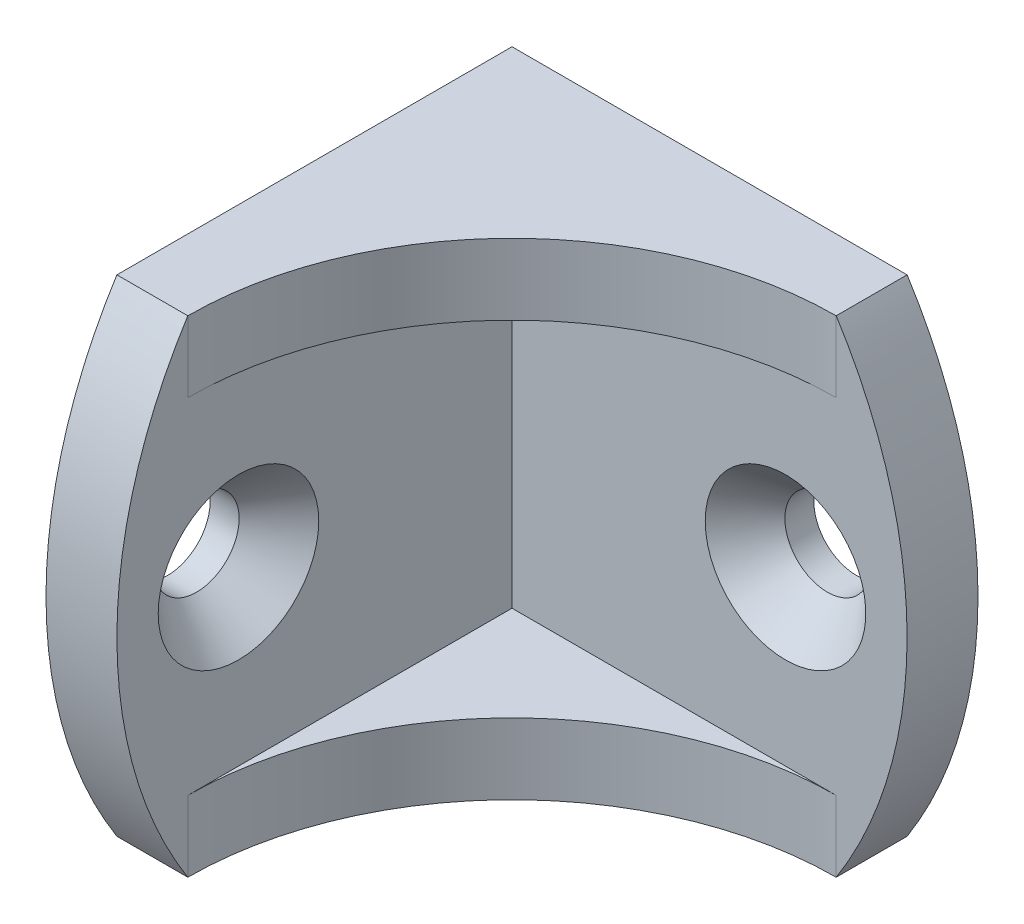
ISO-10303-21;
HEADER;
FILE_DESCRIPTION(('STEP AP214'),'2;1');
FILE_NAME('part.step','',(''),(''),'','','');
FILE_SCHEMA(('AUTOMOTIVE_DESIGN { 1 0 10303 214 1 1 1 1 }'));
ENDSEC;
DATA;
#1=APPLICATION_CONTEXT('core data for automotive mechanical design processes');
#2=APPLICATION_PROTOCOL_DEFINITION('international standard','automotive_design',2000,#1);
#3=PRODUCT_CONTEXT('',#1,'mechanical');
#4=PRODUCT('Part','Part','',(#3));
#5=PRODUCT_RELATED_PRODUCT_CATEGORY('part','',(#4));
#6=PRODUCT_DEFINITION_FORMATION('','',#4);
#7=PRODUCT_DEFINITION_CONTEXT('part definition',#1,'design');
#8=PRODUCT_DEFINITION('design','',#6,#7);
#9=PRODUCT_DEFINITION_SHAPE('','',#8);
#10=(LENGTH_UNIT() NAMED_UNIT(*) SI_UNIT(.MILLI.,.METRE.));
#11=(NAMED_UNIT(*) PLANE_ANGLE_UNIT() SI_UNIT($,.RADIAN.));
#12=(NAMED_UNIT(*) SI_UNIT($,.STERADIAN.) SOLID_ANGLE_UNIT());
#13=UNCERTAINTY_MEASURE_WITH_UNIT(LENGTH_MEASURE(1.E-05),#10,'distance_accuracy_value','');
#14=(GEOMETRIC_REPRESENTATION_CONTEXT(3) GLOBAL_UNCERTAINTY_ASSIGNED_CONTEXT((#13)) GLOBAL_UNIT_ASSIGNED_CONTEXT((#10,
#11,#12)) REPRESENTATION_CONTEXT('',''));
#15=CARTESIAN_POINT('',(0.,0.,0.));
#16=DIRECTION('',(0.,0.,1.));
#17=DIRECTION('',(1.,0.,0.));
#18=AXIS2_PLACEMENT_3D('',#15,#16,#17);
#19=CARTESIAN_POINT('',(17.,0.,0.));
#20=DIRECTION('',(0.,0.,1.));
#21=DIRECTION('',(1.,0.,0.));
#22=AXIS2_PLACEMENT_3D('',#19,#20,#21);
#23=CYLINDRICAL_SURFACE('',#22,2.1);
#24=CARTESIAN_POINT('',(17.,0.,0.));
#25=DIRECTION('',(0.,0.,1.));
#26=DIRECTION('',(-1.,0.,0.));
#27=AXIS2_PLACEMENT_3D('',#24,#25,#26);
#28=CIRCLE('',#27,2.1);
#29=CARTESIAN_POINT('',(14.9,0.,0.));
#30=VERTEX_POINT('',#29);
#31=EDGE_CURVE('E123',#30,#30,#28,.T.);
#32=ORIENTED_EDGE('',*,*,#31,.F.);
#33=EDGE_LOOP('',(#32));
#34=FACE_BOUND('',#33,.T.);
#35=CARTESIAN_POINT('',(17.,0.,1.43159525238213));
#36=DIRECTION('',(0.,0.,1.));
#37=DIRECTION('',(1.,0.,0.));
#38=AXIS2_PLACEMENT_3D('',#35,#36,#37);
#39=CIRCLE('',#38,2.1);
#40=CARTESIAN_POINT('',(19.1,0.,1.43159525238213));
#41=VERTEX_POINT('',#40);
#42=EDGE_CURVE('E40',#41,#41,#39,.F.);
#43=ORIENTED_EDGE('',*,*,#42,.F.);
#44=EDGE_LOOP('',(#43));
#45=FACE_BOUND('',#44,.T.);
#46=ADVANCED_FACE('F36',(#34,#45),#23,.F.);
#47=CARTESIAN_POINT('',(0.,0.,17.));
#48=DIRECTION('',(1.,0.,0.));
#49=DIRECTION('',(0.,0.,-1.));
#50=AXIS2_PLACEMENT_3D('',#47,#48,#49);
#51=CYLINDRICAL_SURFACE('',#50,2.1);
#52=CARTESIAN_POINT('',(0.,0.,17.));
#53=DIRECTION('',(1.,0.,0.));
#54=DIRECTION('',(0.,0.,-1.));
#55=AXIS2_PLACEMENT_3D('',#52,#53,#54);
#56=CIRCLE('',#55,2.1);
#57=CARTESIAN_POINT('',(0.,0.,14.9));
#58=VERTEX_POINT('',#57);
#59=EDGE_CURVE('E166',#58,#58,#56,.T.);
#60=ORIENTED_EDGE('',*,*,#59,.F.);
#61=EDGE_LOOP('',(#60));
#62=FACE_BOUND('',#61,.T.);
#63=CARTESIAN_POINT('',(1.43159525238212,0.,17.));
#64=DIRECTION('',(1.,0.,0.));
#65=DIRECTION('',(0.,0.,-1.));
#66=AXIS2_PLACEMENT_3D('',#63,#64,#65);
#67=CIRCLE('',#66,2.1);
#68=CARTESIAN_POINT('',(1.43159525238212,0.,14.9));
#69=VERTEX_POINT('',#68);
#70=EDGE_CURVE('E114',#69,#69,#67,.F.);
#71=ORIENTED_EDGE('',*,*,#70,.F.);
#72=EDGE_LOOP('',(#71));
#73=FACE_BOUND('',#72,.T.);
#74=ADVANCED_FACE('F221',(#62,#73),#51,.F.);
#75=CARTESIAN_POINT('',(3.5,12.,23.));
#76=DIRECTION('',(-1.,0.,0.));
#77=DIRECTION('',(0.,0.,1.));
#78=AXIS2_PLACEMENT_3D('',#75,#76,#77);
#79=PLANE('',#78);
#80=CARTESIAN_POINT('',(3.5,0.,17.));
#81=DIRECTION('',(-1.,0.,0.));
#82=DIRECTION('',(0.,0.,1.));
#83=AXIS2_PLACEMENT_3D('',#80,#81,#82);
#84=CIRCLE('',#83,3.9624);
#85=CARTESIAN_POINT('',(3.5,0.,20.9624));
#86=VERTEX_POINT('',#85);
#87=EDGE_CURVE('E162',#86,#86,#84,.F.);
#88=ORIENTED_EDGE('',*,*,#87,.F.);
#89=EDGE_LOOP('',(#88));
#90=FACE_BOUND('',#89,.T.);
#91=CARTESIAN_POINT('',(3.5,0.,0.678571428571424));
#92=DIRECTION('',(-1.,0.,0.));
#93=DIRECTION('',(0.,0.,1.));
#94=AXIS2_PLACEMENT_3D('',#91,#92,#93);
#95=CIRCLE('',#94,22.3214285714286);
#96=CARTESIAN_POINT('',(3.5,12.,19.5));
#97=VERTEX_POINT('',#96);
#98=CARTESIAN_POINT('',(3.5,-12.,19.5));
#99=VERTEX_POINT('',#98);
#100=EDGE_CURVE('E175',#97,#99,#95,.F.);
#101=ORIENTED_EDGE('',*,*,#100,.T.);
#102=DIRECTION('',(0.,-1.,0.));
#103=VECTOR('',#102,1.);
#104=CARTESIAN_POINT('',(3.5,-8.5,19.5));
#105=LINE('',#104,#103);
#106=CARTESIAN_POINT('',(3.5,-8.5,19.5));
#107=VERTEX_POINT('',#106);
#108=EDGE_CURVE('E60',#107,#99,#105,.T.);
#109=ORIENTED_EDGE('',*,*,#108,.F.);
#110=DIRECTION('',(0.,0.,1.));
#111=VECTOR('',#110,1.);
#112=CARTESIAN_POINT('',(3.5,-8.5,19.5));
#113=LINE('',#112,#111);
#114=CARTESIAN_POINT('',(3.5,-8.5,3.5));
#115=VERTEX_POINT('',#114);
#116=EDGE_CURVE('E179',#115,#107,#113,.T.);
#117=ORIENTED_EDGE('',*,*,#116,.F.);
#118=DIRECTION('',(0.,-1.,0.));
#119=VECTOR('',#118,1.);
#120=CARTESIAN_POINT('',(3.5,12.,3.5));
#121=LINE('',#120,#119);
#122=CARTESIAN_POINT('',(3.5,8.5,3.5));
#123=VERTEX_POINT('',#122);
#124=EDGE_CURVE('E157',#123,#115,#121,.T.);
#125=ORIENTED_EDGE('',*,*,#124,.F.);
#126=DIRECTION('',(0.,0.,1.));
#127=VECTOR('',#126,1.);
#128=CARTESIAN_POINT('',(3.5,8.5,19.5));
#129=LINE('',#128,#127);
#130=CARTESIAN_POINT('',(3.5,8.5,19.5));
#131=VERTEX_POINT('',#130);
#132=EDGE_CURVE('E133',#123,#131,#129,.T.);
#133=ORIENTED_EDGE('',*,*,#132,.T.);
#134=DIRECTION('',(0.,1.,0.));
#135=VECTOR('',#134,1.);
#136=CARTESIAN_POINT('',(3.5,8.5,19.5));
#137=LINE('',#136,#135);
#138=EDGE_CURVE('E140',#131,#97,#137,.T.);
#139=ORIENTED_EDGE('',*,*,#138,.T.);
#140=EDGE_LOOP('',(#101,#109,#117,#125,#133,#139));
#141=FACE_BOUND('',#140,.T.);
#142=ADVANCED_FACE('F195',(#90,#141),#79,.F.);
#143=CARTESIAN_POINT('',(0.,12.,0.));
#144=DIRECTION('',(1.,0.,0.));
#145=DIRECTION('',(0.,0.,-1.));
#146=AXIS2_PLACEMENT_3D('',#143,#144,#145);
#147=PLANE('',#146);
#148=ORIENTED_EDGE('',*,*,#59,.T.);
#149=EDGE_LOOP('',(#148));
#150=FACE_BOUND('',#149,.T.);
#151=DIRECTION('',(0.,0.,1.));
#152=VECTOR('',#151,1.);
#153=CARTESIAN_POINT('',(0.,-12.,0.));
#154=LINE('',#153,#152);
#155=CARTESIAN_POINT('',(0.,-12.,0.));
#156=VERTEX_POINT('',#155);
#157=CARTESIAN_POINT('',(0.,-12.,19.5));
#158=VERTEX_POINT('',#157);
#159=EDGE_CURVE('E139',#156,#158,#154,.T.);
#160=ORIENTED_EDGE('',*,*,#159,.T.);
#161=CARTESIAN_POINT('',(0.,0.,0.678571428571424));
#162=DIRECTION('',(1.,0.,0.));
#163=DIRECTION('',(0.,0.,-1.));
#164=AXIS2_PLACEMENT_3D('',#161,#162,#163);
#165=CIRCLE('',#164,22.3214285714286);
#166=CARTESIAN_POINT('',(0.,12.,19.5));
#167=VERTEX_POINT('',#166);
#168=EDGE_CURVE('E52',#158,#167,#165,.F.);
#169=ORIENTED_EDGE('',*,*,#168,.T.);
#170=DIRECTION('',(0.,0.,1.));
#171=VECTOR('',#170,1.);
#172=CARTESIAN_POINT('',(0.,12.,0.));
#173=LINE('',#172,#171);
#174=CARTESIAN_POINT('',(0.,12.,0.));
#175=VERTEX_POINT('',#174);
#176=EDGE_CURVE('E150',#175,#167,#173,.T.);
#177=ORIENTED_EDGE('',*,*,#176,.F.);
#178=DIRECTION('',(0.,-1.,0.));
#179=VECTOR('',#178,1.);
#180=CARTESIAN_POINT('',(0.,12.,0.));
#181=LINE('',#180,#179);
#182=EDGE_CURVE('E154',#175,#156,#181,.T.);
#183=ORIENTED_EDGE('',*,*,#182,.T.);
#184=EDGE_LOOP('',(#160,#169,#177,#183));
#185=FACE_BOUND('',#184,.T.);
#186=ADVANCED_FACE('F38',(#150,#185),#147,.F.);
#187=CARTESIAN_POINT('',(23.,12.,3.5));
#188=DIRECTION('',(0.,0.,-1.));
#189=DIRECTION('',(-1.,0.,0.));
#190=AXIS2_PLACEMENT_3D('',#187,#188,#189);
#191=PLANE('',#190);
#192=CARTESIAN_POINT('',(17.,0.,3.5));
#193=DIRECTION('',(0.,0.,-1.));
#194=DIRECTION('',(-1.,0.,0.));
#195=AXIS2_PLACEMENT_3D('',#192,#193,#194);
#196=CIRCLE('',#195,3.96239999999999);
#197=CARTESIAN_POINT('',(13.0376,0.,3.5));
#198=VERTEX_POINT('',#197);
#199=EDGE_CURVE('E358',#198,#198,#196,.F.);
#200=ORIENTED_EDGE('',*,*,#199,.F.);
#201=EDGE_LOOP('',(#200));
#202=FACE_BOUND('',#201,.T.);
#203=DIRECTION('',(0.,-1.,0.));
#204=VECTOR('',#203,1.);
#205=CARTESIAN_POINT('',(19.5,-8.5,3.5));
#206=LINE('',#205,#204);
#207=CARTESIAN_POINT('',(19.5,-8.5,3.5));
#208=VERTEX_POINT('',#207);
#209=CARTESIAN_POINT('',(19.5,-12.,3.5));
#210=VERTEX_POINT('',#209);
#211=EDGE_CURVE('E110',#208,#210,#206,.T.);
#212=ORIENTED_EDGE('',*,*,#211,.T.);
#213=CARTESIAN_POINT('',(0.678571428571423,0.,3.50000000000001));
#214=DIRECTION('',(0.,0.,-1.));
#215=DIRECTION('',(-1.,0.,0.));
#216=AXIS2_PLACEMENT_3D('',#213,#214,#215);
#217=CIRCLE('',#216,22.3214285714286);
#218=CARTESIAN_POINT('',(19.5,12.,3.5));
#219=VERTEX_POINT('',#218);
#220=EDGE_CURVE('E103',#210,#219,#217,.F.);
#221=ORIENTED_EDGE('',*,*,#220,.T.);
#222=DIRECTION('',(0.,1.,0.));
#223=VECTOR('',#222,1.);
#224=CARTESIAN_POINT('',(19.5,8.5,3.5));
#225=LINE('',#224,#223);
#226=CARTESIAN_POINT('',(19.5,8.5,3.5));
#227=VERTEX_POINT('',#226);
#228=EDGE_CURVE('E108',#227,#219,#225,.T.);
#229=ORIENTED_EDGE('',*,*,#228,.F.);
#230=DIRECTION('',(-1.,0.,0.));
#231=VECTOR('',#230,1.);
#232=CARTESIAN_POINT('',(3.5,8.5,3.5));
#233=LINE('',#232,#231);
#234=EDGE_CURVE('E145',#227,#123,#233,.T.);
#235=ORIENTED_EDGE('',*,*,#234,.T.);
#236=ORIENTED_EDGE('',*,*,#124,.T.);
#237=DIRECTION('',(-1.,0.,0.));
#238=VECTOR('',#237,1.);
#239=CARTESIAN_POINT('',(3.5,-8.5,3.5));
#240=LINE('',#239,#238);
#241=EDGE_CURVE('E182',#208,#115,#240,.T.);
#242=ORIENTED_EDGE('',*,*,#241,.F.);
#243=EDGE_LOOP('',(#212,#221,#229,#235,#236,#242));
#244=FACE_BOUND('',#243,.T.);
#245=ADVANCED_FACE('F105',(#202,#244),#191,.F.);
#246=CARTESIAN_POINT('',(0.,12.,0.));
#247=DIRECTION('',(0.,0.,1.));
#248=DIRECTION('',(1.,0.,0.));
#249=AXIS2_PLACEMENT_3D('',#246,#247,#248);
#250=PLANE('',#249);
#251=ORIENTED_EDGE('',*,*,#31,.T.);
#252=EDGE_LOOP('',(#251));
#253=FACE_BOUND('',#252,.T.);
#254=CARTESIAN_POINT('',(0.678571428571424,0.,0.));
#255=DIRECTION('',(0.,0.,1.));
#256=DIRECTION('',(1.,0.,0.));
#257=AXIS2_PLACEMENT_3D('',#254,#255,#256);
#258=CIRCLE('',#257,22.3214285714286);
#259=CARTESIAN_POINT('',(19.5,12.,0.));
#260=VERTEX_POINT('',#259);
#261=CARTESIAN_POINT('',(19.5,-12.,0.));
#262=VERTEX_POINT('',#261);
#263=EDGE_CURVE('E115',#260,#262,#258,.F.);
#264=ORIENTED_EDGE('',*,*,#263,.T.);
#265=DIRECTION('',(-1.,0.,0.));
#266=VECTOR('',#265,1.);
#267=CARTESIAN_POINT('',(0.,-12.,0.));
#268=LINE('',#267,#266);
#269=EDGE_CURVE('E143',#262,#156,#268,.T.);
#270=ORIENTED_EDGE('',*,*,#269,.T.);
#271=ORIENTED_EDGE('',*,*,#182,.F.);
#272=DIRECTION('',(-1.,0.,0.));
#273=VECTOR('',#272,1.);
#274=CARTESIAN_POINT('',(0.,12.,0.));
#275=LINE('',#274,#273);
#276=EDGE_CURVE('E152',#260,#175,#275,.T.);
#277=ORIENTED_EDGE('',*,*,#276,.F.);
#278=EDGE_LOOP('',(#264,#270,#271,#277));
#279=FACE_BOUND('',#278,.T.);
#280=ADVANCED_FACE('F207',(#253,#279),#250,.F.);
#281=CARTESIAN_POINT('',(0.,12.,0.));
#282=DIRECTION('',(0.,1.,0.));
#283=DIRECTION('',(0.,0.,1.));
#284=AXIS2_PLACEMENT_3D('',#281,#282,#283);
#285=PLANE('',#284);
#286=DIRECTION('',(0.,0.,-1.));
#287=VECTOR('',#286,1.);
#288=CARTESIAN_POINT('',(19.5,12.,58.4034573285193));
#289=LINE('',#288,#287);
#290=EDGE_CURVE('E118',#219,#260,#289,.T.);
#291=ORIENTED_EDGE('',*,*,#290,.T.);
#292=ORIENTED_EDGE('',*,*,#276,.T.);
#293=ORIENTED_EDGE('',*,*,#176,.T.);
#294=DIRECTION('',(-1.,0.,0.));
#295=VECTOR('',#294,1.);
#296=CARTESIAN_POINT('',(54.0284573285193,12.,19.5));
#297=LINE('',#296,#295);
#298=EDGE_CURVE('E130',#97,#167,#297,.T.);
#299=ORIENTED_EDGE('',*,*,#298,.F.);
#300=CARTESIAN_POINT('',(19.5,12.,19.5));
#301=DIRECTION('',(0.,-1.,0.));
#302=DIRECTION('',(0.,0.,1.));
#303=AXIS2_PLACEMENT_3D('',#300,#301,#302);
#304=CIRCLE('',#303,16.);
#305=EDGE_CURVE('E127',#97,#219,#304,.T.);
#306=ORIENTED_EDGE('',*,*,#305,.T.);
#307=EDGE_LOOP('',(#291,#292,#293,#299,#306));
#308=FACE_BOUND('',#307,.T.);
#309=ADVANCED_FACE('F128',(#308),#285,.T.);
#310=CARTESIAN_POINT('',(0.,-12.,0.));
#311=DIRECTION('',(0.,1.,0.));
#312=DIRECTION('',(0.,0.,1.));
#313=AXIS2_PLACEMENT_3D('',#310,#311,#312);
#314=PLANE('',#313);
#315=ORIENTED_EDGE('',*,*,#269,.F.);
#316=DIRECTION('',(0.,0.,-1.));
#317=VECTOR('',#316,1.);
#318=CARTESIAN_POINT('',(19.5,-12.,58.4034573285193));
#319=LINE('',#318,#317);
#320=EDGE_CURVE('E11',#262,#210,#319,.F.);
#321=ORIENTED_EDGE('',*,*,#320,.T.);
#322=CARTESIAN_POINT('',(19.5,-12.,19.5));
#323=DIRECTION('',(0.,-1.,0.));
#324=DIRECTION('',(0.,0.,1.));
#325=AXIS2_PLACEMENT_3D('',#322,#323,#324);
#326=CIRCLE('',#325,16.);
#327=EDGE_CURVE('E177',#99,#210,#326,.T.);
#328=ORIENTED_EDGE('',*,*,#327,.F.);
#329=DIRECTION('',(-1.,0.,0.));
#330=VECTOR('',#329,1.);
#331=CARTESIAN_POINT('',(54.0284573285193,-12.,19.5));
#332=LINE('',#331,#330);
#333=EDGE_CURVE('E45',#99,#158,#332,.T.);
#334=ORIENTED_EDGE('',*,*,#333,.T.);
#335=ORIENTED_EDGE('',*,*,#159,.F.);
#336=EDGE_LOOP('',(#315,#321,#328,#334,#335));
#337=FACE_BOUND('',#336,.T.);
#338=ADVANCED_FACE('F203',(#337),#314,.F.);
#339=CARTESIAN_POINT('',(19.5,8.5,19.5));
#340=DIRECTION('',(0.,1.,0.));
#341=DIRECTION('',(0.,0.,1.));
#342=AXIS2_PLACEMENT_3D('',#339,#340,#341);
#343=CYLINDRICAL_SURFACE('',#342,16.);
#344=ORIENTED_EDGE('',*,*,#305,.F.);
#345=ORIENTED_EDGE('',*,*,#138,.F.);
#346=CARTESIAN_POINT('',(19.5,8.5,19.5));
#347=DIRECTION('',(0.,-1.,0.));
#348=DIRECTION('',(0.,0.,1.));
#349=AXIS2_PLACEMENT_3D('',#346,#347,#348);
#350=CIRCLE('',#349,16.);
#351=EDGE_CURVE('E137',#131,#227,#350,.T.);
#352=ORIENTED_EDGE('',*,*,#351,.T.);
#353=ORIENTED_EDGE('',*,*,#228,.T.);
#354=EDGE_LOOP('',(#344,#345,#352,#353));
#355=FACE_BOUND('',#354,.T.);
#356=ADVANCED_FACE('F135',(#355),#343,.F.);
#357=CARTESIAN_POINT('',(19.5,8.5,19.5));
#358=DIRECTION('',(0.,1.,0.));
#359=DIRECTION('',(0.,0.,1.));
#360=AXIS2_PLACEMENT_3D('',#357,#358,#359);
#361=PLANE('',#360);
#362=ORIENTED_EDGE('',*,*,#132,.F.);
#363=ORIENTED_EDGE('',*,*,#234,.F.);
#364=ORIENTED_EDGE('',*,*,#351,.F.);
#365=EDGE_LOOP('',(#362,#363,#364));
#366=FACE_BOUND('',#365,.T.);
#367=ADVANCED_FACE('F211',(#366),#361,.F.);
#368=CARTESIAN_POINT('',(19.5,-8.5,19.5));
#369=DIRECTION('',(0.,-1.,0.));
#370=DIRECTION('',(0.,0.,-1.));
#371=AXIS2_PLACEMENT_3D('',#368,#369,#370);
#372=CYLINDRICAL_SURFACE('',#371,16.);
#373=ORIENTED_EDGE('',*,*,#327,.T.);
#374=ORIENTED_EDGE('',*,*,#211,.F.);
#375=CARTESIAN_POINT('',(19.5,-8.5,19.5));
#376=DIRECTION('',(0.,-1.,0.));
#377=DIRECTION('',(0.,0.,1.));
#378=AXIS2_PLACEMENT_3D('',#375,#376,#377);
#379=CIRCLE('',#378,16.);
#380=EDGE_CURVE('E185',#107,#208,#379,.T.);
#381=ORIENTED_EDGE('',*,*,#380,.F.);
#382=ORIENTED_EDGE('',*,*,#108,.T.);
#383=EDGE_LOOP('',(#373,#374,#381,#382));
#384=FACE_BOUND('',#383,.T.);
#385=ADVANCED_FACE('F199',(#384),#372,.F.);
#386=CARTESIAN_POINT('',(19.5,-8.5,19.5));
#387=DIRECTION('',(0.,-1.,0.));
#388=DIRECTION('',(0.,0.,1.));
#389=AXIS2_PLACEMENT_3D('',#386,#387,#388);
#390=PLANE('',#389);
#391=ORIENTED_EDGE('',*,*,#116,.T.);
#392=ORIENTED_EDGE('',*,*,#380,.T.);
#393=ORIENTED_EDGE('',*,*,#241,.T.);
#394=EDGE_LOOP('',(#391,#392,#393));
#395=FACE_BOUND('',#394,.T.);
#396=ADVANCED_FACE('F197',(#395),#390,.F.);
#397=CARTESIAN_POINT('',(54.0284573285193,0.,0.67857142857143));
#398=DIRECTION('',(-1.,0.,0.));
#399=DIRECTION('',(0.,0.,1.));
#400=AXIS2_PLACEMENT_3D('',#397,#398,#399);
#401=CYLINDRICAL_SURFACE('',#400,22.3214285714286);
#402=ORIENTED_EDGE('',*,*,#333,.F.);
#403=ORIENTED_EDGE('',*,*,#100,.F.);
#404=ORIENTED_EDGE('',*,*,#298,.T.);
#405=ORIENTED_EDGE('',*,*,#168,.F.);
#406=EDGE_LOOP('',(#402,#403,#404,#405));
#407=FACE_BOUND('',#406,.T.);
#408=ADVANCED_FACE('F210',(#407),#401,.T.);
#409=CARTESIAN_POINT('',(3.5,0.,17.));
#410=DIRECTION('',(1.,0.,0.));
#411=DIRECTION('',(0.,0.,-1.));
#412=AXIS2_PLACEMENT_3D('',#409,#410,#411);
#413=CONICAL_SURFACE('',#412,3.9624,0.73303828583762);
#414=ORIENTED_EDGE('',*,*,#70,.T.);
#415=EDGE_LOOP('',(#414));
#416=FACE_BOUND('',#415,.T.);
#417=ORIENTED_EDGE('',*,*,#87,.T.);
#418=EDGE_LOOP('',(#417));
#419=FACE_BOUND('',#418,.T.);
#420=ADVANCED_FACE('F236',(#416,#419),#413,.F.);
#421=CARTESIAN_POINT('',(0.678571428571418,0.,58.4034573285193));
#422=DIRECTION('',(0.,0.,-1.));
#423=DIRECTION('',(-1.,0.,0.));
#424=AXIS2_PLACEMENT_3D('',#421,#422,#423);
#425=CYLINDRICAL_SURFACE('',#424,22.3214285714286);
#426=ORIENTED_EDGE('',*,*,#220,.F.);
#427=ORIENTED_EDGE('',*,*,#320,.F.);
#428=ORIENTED_EDGE('',*,*,#263,.F.);
#429=ORIENTED_EDGE('',*,*,#290,.F.);
#430=EDGE_LOOP('',(#426,#427,#428,#429));
#431=FACE_BOUND('',#430,.T.);
#432=ADVANCED_FACE('F120',(#431),#425,.T.);
#433=CARTESIAN_POINT('',(17.,0.,3.50000000000001));
#434=DIRECTION('',(0.,0.,1.));
#435=DIRECTION('',(-1.,0.,0.));
#436=AXIS2_PLACEMENT_3D('',#433,#434,#435);
#437=CONICAL_SURFACE('',#436,3.9624,0.73303828583762);
#438=ORIENTED_EDGE('',*,*,#42,.T.);
#439=EDGE_LOOP('',(#438));
#440=FACE_BOUND('',#439,.T.);
#441=ORIENTED_EDGE('',*,*,#199,.T.);
#442=EDGE_LOOP('',(#441));
#443=FACE_BOUND('',#442,.T.);
#444=ADVANCED_FACE('F233',(#440,#443),#437,.F.);
#445=CLOSED_SHELL('',(#46,#74,#142,#186,#245,#280,#309,#338,#356,#367,#385,#396,#408,#420,#432,#444));
#446=MANIFOLD_SOLID_BREP('B2',#445);
#447=ADVANCED_BREP_SHAPE_REPRESENTATION('',(#18,#446),#14);
#448=SHAPE_DEFINITION_REPRESENTATION(#9,#447);
ENDSEC;
END-ISO-10303-21;
